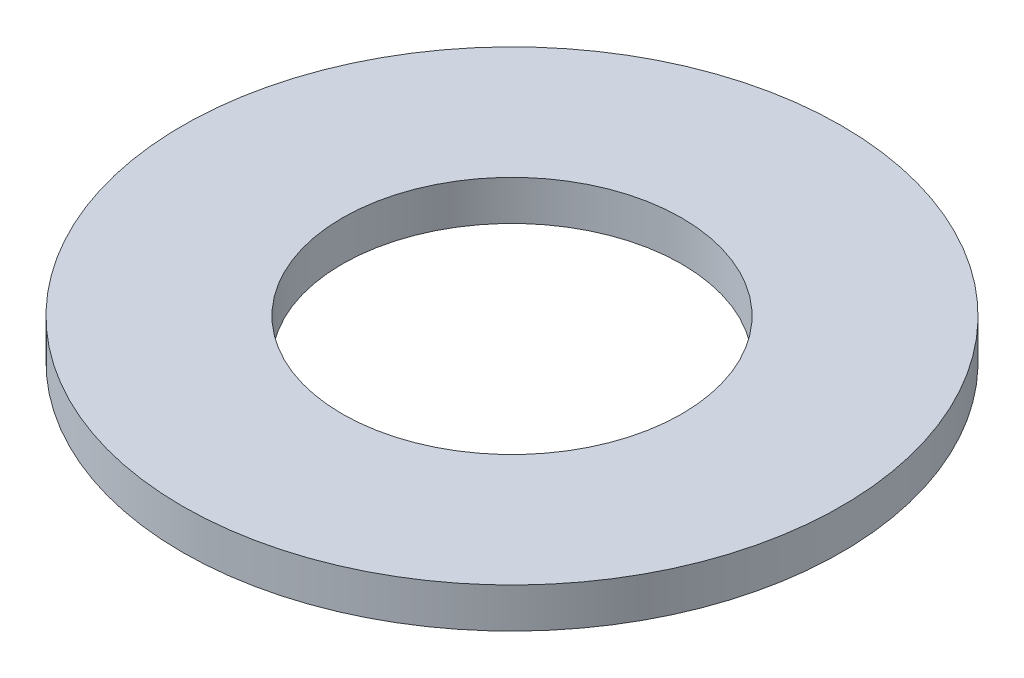
ISO-10303-21;
HEADER;
FILE_DESCRIPTION(('STEP AP214'),'2;1');
FILE_NAME('part.step','',(''),(''),'','','');
FILE_SCHEMA(('AUTOMOTIVE_DESIGN { 1 0 10303 214 1 1 1 1 }'));
ENDSEC;
DATA;
#1=APPLICATION_CONTEXT('core data for automotive mechanical design processes');
#2=APPLICATION_PROTOCOL_DEFINITION('international standard','automotive_design',2000,#1);
#3=PRODUCT_CONTEXT('',#1,'mechanical');
#4=PRODUCT('Part','Part','',(#3));
#5=PRODUCT_RELATED_PRODUCT_CATEGORY('part','',(#4));
#6=PRODUCT_DEFINITION_FORMATION('','',#4);
#7=PRODUCT_DEFINITION_CONTEXT('part definition',#1,'design');
#8=PRODUCT_DEFINITION('design','',#6,#7);
#9=PRODUCT_DEFINITION_SHAPE('','',#8);
#10=(LENGTH_UNIT() NAMED_UNIT(*) SI_UNIT(.MILLI.,.METRE.));
#11=(NAMED_UNIT(*) PLANE_ANGLE_UNIT() SI_UNIT($,.RADIAN.));
#12=(NAMED_UNIT(*) SI_UNIT($,.STERADIAN.) SOLID_ANGLE_UNIT());
#13=UNCERTAINTY_MEASURE_WITH_UNIT(LENGTH_MEASURE(1.E-05),#10,'distance_accuracy_value','');
#14=(GEOMETRIC_REPRESENTATION_CONTEXT(3) GLOBAL_UNCERTAINTY_ASSIGNED_CONTEXT((#13)) GLOBAL_UNIT_ASSIGNED_CONTEXT((#10,
#11,#12)) REPRESENTATION_CONTEXT('',''));
#15=CARTESIAN_POINT('',(0.,0.,0.));
#16=DIRECTION('',(0.,0.,1.));
#17=DIRECTION('',(1.,0.,0.));
#18=AXIS2_PLACEMENT_3D('',#15,#16,#17);
#19=CARTESIAN_POINT('',(0.,10.,0.));
#20=DIRECTION('',(0.,-1.,0.));
#21=DIRECTION('',(0.,0.,-1.));
#22=AXIS2_PLACEMENT_3D('',#19,#20,#21);
#23=CYLINDRICAL_SURFACE('',#22,82.5);
#24=CARTESIAN_POINT('',(0.,10.,0.));
#25=DIRECTION('',(0.,1.,0.));
#26=DIRECTION('',(0.,0.,1.));
#27=AXIS2_PLACEMENT_3D('',#24,#25,#26);
#28=CIRCLE('',#27,82.5);
#29=CARTESIAN_POINT('',(0.,10.,82.5));
#30=VERTEX_POINT('',#29);
#31=EDGE_CURVE('E10',#30,#30,#28,.T.);
#32=ORIENTED_EDGE('',*,*,#31,.F.);
#33=EDGE_LOOP('',(#32));
#34=FACE_BOUND('',#33,.T.);
#35=CARTESIAN_POINT('',(0.,0.,0.));
#36=DIRECTION('',(0.,1.,0.));
#37=DIRECTION('',(0.,0.,1.));
#38=AXIS2_PLACEMENT_3D('',#35,#36,#37);
#39=CIRCLE('',#38,82.5);
#40=CARTESIAN_POINT('',(0.,0.,82.5));
#41=VERTEX_POINT('',#40);
#42=EDGE_CURVE('E37',#41,#41,#39,.T.);
#43=ORIENTED_EDGE('',*,*,#42,.T.);
#44=EDGE_LOOP('',(#43));
#45=FACE_BOUND('',#44,.T.);
#46=ADVANCED_FACE('F40',(#34,#45),#23,.T.);
#47=CARTESIAN_POINT('',(0.,10.,0.));
#48=DIRECTION('',(0.,1.,0.));
#49=DIRECTION('',(0.,0.,1.));
#50=AXIS2_PLACEMENT_3D('',#47,#48,#49);
#51=PLANE('',#50);
#52=CARTESIAN_POINT('',(0.,10.,0.));
#53=DIRECTION('',(0.,1.,0.));
#54=DIRECTION('',(0.,0.,1.));
#55=AXIS2_PLACEMENT_3D('',#52,#53,#54);
#56=CIRCLE('',#55,42.5);
#57=CARTESIAN_POINT('',(0.,10.,42.5));
#58=VERTEX_POINT('',#57);
#59=EDGE_CURVE('E50',#58,#58,#56,.T.);
#60=ORIENTED_EDGE('',*,*,#59,.F.);
#61=EDGE_LOOP('',(#60));
#62=FACE_BOUND('',#61,.T.);
#63=ORIENTED_EDGE('',*,*,#31,.T.);
#64=EDGE_LOOP('',(#63));
#65=FACE_BOUND('',#64,.T.);
#66=ADVANCED_FACE('F59',(#62,#65),#51,.T.);
#67=CARTESIAN_POINT('',(0.,0.,0.));
#68=DIRECTION('',(0.,1.,0.));
#69=DIRECTION('',(0.,0.,1.));
#70=AXIS2_PLACEMENT_3D('',#67,#68,#69);
#71=PLANE('',#70);
#72=CARTESIAN_POINT('',(0.,0.,0.));
#73=DIRECTION('',(0.,1.,0.));
#74=DIRECTION('',(0.,0.,1.));
#75=AXIS2_PLACEMENT_3D('',#72,#73,#74);
#76=CIRCLE('',#75,42.5);
#77=CARTESIAN_POINT('',(0.,0.,42.5));
#78=VERTEX_POINT('',#77);
#79=EDGE_CURVE('E47',#78,#78,#76,.T.);
#80=ORIENTED_EDGE('',*,*,#79,.T.);
#81=EDGE_LOOP('',(#80));
#82=FACE_BOUND('',#81,.T.);
#83=ORIENTED_EDGE('',*,*,#42,.F.);
#84=EDGE_LOOP('',(#83));
#85=FACE_BOUND('',#84,.T.);
#86=ADVANCED_FACE('F58',(#82,#85),#71,.F.);
#87=CARTESIAN_POINT('',(0.,10.,0.));
#88=DIRECTION('',(0.,-1.,0.));
#89=DIRECTION('',(0.,0.,-1.));
#90=AXIS2_PLACEMENT_3D('',#87,#88,#89);
#91=CYLINDRICAL_SURFACE('',#90,42.5);
#92=ORIENTED_EDGE('',*,*,#59,.T.);
#93=EDGE_LOOP('',(#92));
#94=FACE_BOUND('',#93,.T.);
#95=ORIENTED_EDGE('',*,*,#79,.F.);
#96=EDGE_LOOP('',(#95));
#97=FACE_BOUND('',#96,.T.);
#98=ADVANCED_FACE('F54',(#94,#97),#91,.F.);
#99=CLOSED_SHELL('',(#46,#66,#86,#98));
#100=MANIFOLD_SOLID_BREP('B2',#99);
#101=ADVANCED_BREP_SHAPE_REPRESENTATION('',(#18,#100),#14);
#102=SHAPE_DEFINITION_REPRESENTATION(#9,#101);
ENDSEC;
END-ISO-10303-21;
